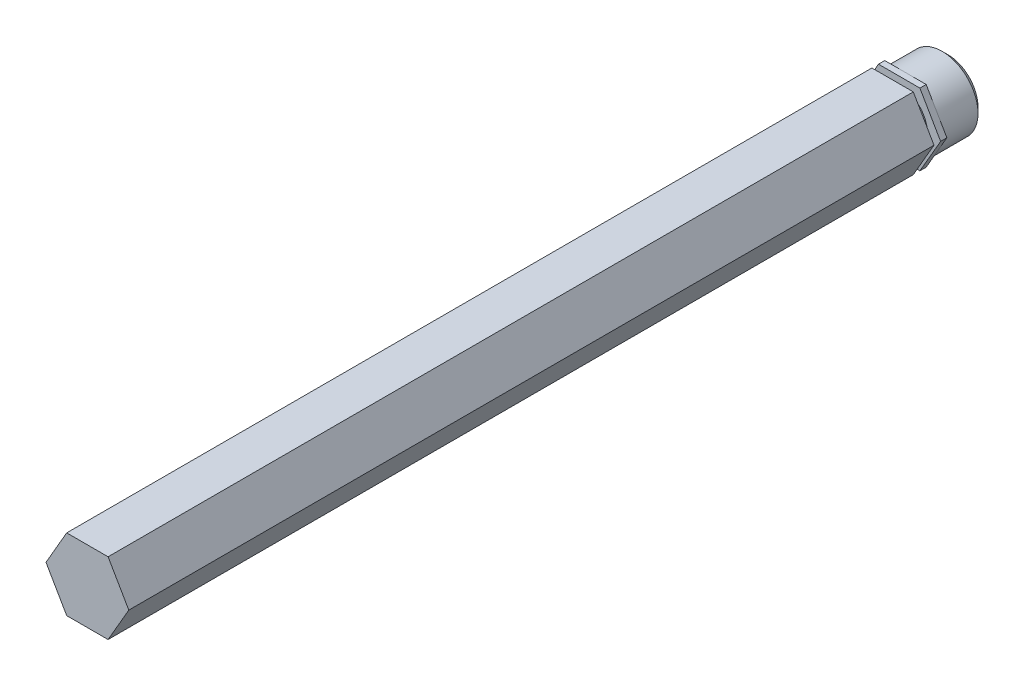
ISO-10303-21;
HEADER;
FILE_DESCRIPTION(('STEP AP214'),'2;1');
FILE_NAME('part.step','',(''),(''),'','','');
FILE_SCHEMA(('AUTOMOTIVE_DESIGN { 1 0 10303 214 1 1 1 1 }'));
ENDSEC;
DATA;
#1=APPLICATION_CONTEXT('core data for automotive mechanical design processes');
#2=APPLICATION_PROTOCOL_DEFINITION('international standard','automotive_design',2000,#1);
#3=PRODUCT_CONTEXT('',#1,'mechanical');
#4=PRODUCT('Part','Part','',(#3));
#5=PRODUCT_RELATED_PRODUCT_CATEGORY('part','',(#4));
#6=PRODUCT_DEFINITION_FORMATION('','',#4);
#7=PRODUCT_DEFINITION_CONTEXT('part definition',#1,'design');
#8=PRODUCT_DEFINITION('design','',#6,#7);
#9=PRODUCT_DEFINITION_SHAPE('','',#8);
#10=(LENGTH_UNIT() NAMED_UNIT(*) SI_UNIT(.MILLI.,.METRE.));
#11=(NAMED_UNIT(*) PLANE_ANGLE_UNIT() SI_UNIT($,.RADIAN.));
#12=(NAMED_UNIT(*) SI_UNIT($,.STERADIAN.) SOLID_ANGLE_UNIT());
#13=UNCERTAINTY_MEASURE_WITH_UNIT(LENGTH_MEASURE(1.E-05),#10,'distance_accuracy_value','');
#14=(GEOMETRIC_REPRESENTATION_CONTEXT(3) GLOBAL_UNCERTAINTY_ASSIGNED_CONTEXT((#13)) GLOBAL_UNIT_ASSIGNED_CONTEXT((#10,
#11,#12)) REPRESENTATION_CONTEXT('',''));
#15=CARTESIAN_POINT('',(0.,0.,0.));
#16=DIRECTION('',(0.,0.,1.));
#17=DIRECTION('',(1.,0.,0.));
#18=AXIS2_PLACEMENT_3D('',#15,#16,#17);
#19=CARTESIAN_POINT('',(7.33234841870824,0.,-76.2));
#20=DIRECTION('',(0.,0.,1.));
#21=DIRECTION('',(1.,0.,0.));
#22=AXIS2_PLACEMENT_3D('',#19,#20,#21);
#23=PLANE('',#22);
#24=CARTESIAN_POINT('',(0.,0.,-76.1999999999716));
#25=DIRECTION('',(0.,0.,1.));
#26=DIRECTION('',(1.,0.,0.));
#27=AXIS2_PLACEMENT_3D('',#24,#25,#26);
#28=CIRCLE('',#27,5.35000000002128);
#29=CARTESIAN_POINT('',(5.35000000002128,0.,-76.1999999999716));
#30=VERTEX_POINT('',#29);
#31=EDGE_CURVE('E19',#30,#30,#28,.T.);
#32=ORIENTED_EDGE('',*,*,#31,.F.);
#33=EDGE_LOOP('',(#32));
#34=FACE_BOUND('',#33,.T.);
#35=ADVANCED_FACE('F16',(#34),#23,.F.);
#36=CARTESIAN_POINT('',(0.,0.,-75.1999999999953));
#37=DIRECTION('',(0.,0.,1.));
#38=DIRECTION('',(1.,0.,0.));
#39=AXIS2_PLACEMENT_3D('',#36,#37,#38);
#40=CONICAL_SURFACE('',#39,6.34999999999764,0.785398163397448);
#41=ORIENTED_EDGE('',*,*,#31,.T.);
#42=EDGE_LOOP('',(#41));
#43=FACE_BOUND('',#42,.T.);
#44=CARTESIAN_POINT('',(0.,0.,-75.2));
#45=DIRECTION('',(0.,0.,-1.));
#46=DIRECTION('',(-1.,0.,0.));
#47=AXIS2_PLACEMENT_3D('',#44,#45,#46);
#48=CIRCLE('',#47,6.35);
#49=CARTESIAN_POINT('',(-6.35,0.,-75.2));
#50=VERTEX_POINT('',#49);
#51=EDGE_CURVE('E133',#50,#50,#48,.F.);
#52=ORIENTED_EDGE('',*,*,#51,.F.);
#53=EDGE_LOOP('',(#52));
#54=FACE_BOUND('',#53,.T.);
#55=ADVANCED_FACE('F503',(#43,#54),#40,.T.);
#56=CARTESIAN_POINT('',(0.,0.,-68.704));
#57=DIRECTION('',(0.,0.,-1.));
#58=DIRECTION('',(-1.,0.,0.));
#59=AXIS2_PLACEMENT_3D('',#56,#57,#58);
#60=CYLINDRICAL_SURFACE('',#59,6.35);
#61=CARTESIAN_POINT('',(0.,0.,-68.704));
#62=DIRECTION('',(0.,0.,-1.));
#63=DIRECTION('',(-1.,0.,0.));
#64=AXIS2_PLACEMENT_3D('',#61,#62,#63);
#65=CIRCLE('',#64,6.35);
#66=CARTESIAN_POINT('',(5.49926131403119,-3.17499999999999,-68.704));
#67=VERTEX_POINT('',#66);
#68=CARTESIAN_POINT('',(5.49926131403118,3.17499999999999,-68.704));
#69=VERTEX_POINT('',#68);
#70=EDGE_CURVE('E120',#67,#69,#65,.F.);
#71=ORIENTED_EDGE('',*,*,#70,.F.);
#72=CARTESIAN_POINT('',(0.,0.,-68.704));
#73=DIRECTION('',(0.,0.,-1.));
#74=DIRECTION('',(-1.,0.,0.));
#75=AXIS2_PLACEMENT_3D('',#72,#73,#74);
#76=CIRCLE('',#75,6.35);
#77=CARTESIAN_POINT('',(0.,-6.35000000000002,-68.704));
#78=VERTEX_POINT('',#77);
#79=EDGE_CURVE('E128',#78,#67,#76,.F.);
#80=ORIENTED_EDGE('',*,*,#79,.F.);
#81=CARTESIAN_POINT('',(0.,0.,-68.704));
#82=DIRECTION('',(0.,0.,-1.));
#83=DIRECTION('',(-1.,0.,0.));
#84=AXIS2_PLACEMENT_3D('',#81,#82,#83);
#85=CIRCLE('',#84,6.35);
#86=CARTESIAN_POINT('',(-5.49926131403119,-3.17500000000001,-68.704));
#87=VERTEX_POINT('',#86);
#88=EDGE_CURVE('E141',#87,#78,#85,.F.);
#89=ORIENTED_EDGE('',*,*,#88,.F.);
#90=CARTESIAN_POINT('',(0.,0.,-68.704));
#91=DIRECTION('',(0.,0.,-1.));
#92=DIRECTION('',(-1.,0.,0.));
#93=AXIS2_PLACEMENT_3D('',#90,#91,#92);
#94=CIRCLE('',#93,6.35);
#95=CARTESIAN_POINT('',(-5.49926131403119,3.175,-68.704));
#96=VERTEX_POINT('',#95);
#97=EDGE_CURVE('E142',#96,#87,#94,.F.);
#98=ORIENTED_EDGE('',*,*,#97,.F.);
#99=CARTESIAN_POINT('',(0.,0.,-68.704));
#100=DIRECTION('',(0.,0.,-1.));
#101=DIRECTION('',(-1.,0.,0.));
#102=AXIS2_PLACEMENT_3D('',#99,#100,#101);
#103=CIRCLE('',#102,6.35);
#104=CARTESIAN_POINT('',(0.,6.35000000000001,-68.704));
#105=VERTEX_POINT('',#104);
#106=EDGE_CURVE('E177',#105,#96,#103,.F.);
#107=ORIENTED_EDGE('',*,*,#106,.F.);
#108=CARTESIAN_POINT('',(0.,0.,-68.704));
#109=DIRECTION('',(0.,0.,-1.));
#110=DIRECTION('',(-1.,0.,0.));
#111=AXIS2_PLACEMENT_3D('',#108,#109,#110);
#112=CIRCLE('',#111,6.35);
#113=EDGE_CURVE('E131',#69,#105,#112,.F.);
#114=ORIENTED_EDGE('',*,*,#113,.F.);
#115=EDGE_LOOP('',(#71,#80,#89,#98,#107,#114));
#116=FACE_BOUND('',#115,.T.);
#117=ORIENTED_EDGE('',*,*,#51,.T.);
#118=EDGE_LOOP('',(#117));
#119=FACE_BOUND('',#118,.T.);
#120=ADVANCED_FACE('F125',(#116,#119),#60,.T.);
#121=CARTESIAN_POINT('',(0.,0.,-68.704));
#122=DIRECTION('',(0.,0.,-1.));
#123=DIRECTION('',(-1.,0.,0.));
#124=AXIS2_PLACEMENT_3D('',#121,#122,#123);
#125=PLANE('',#124);
#126=DIRECTION('',(-0.499999999999999,-0.866025403784439,0.));
#127=VECTOR('',#126,1.);
#128=CARTESIAN_POINT('',(3.6661742093541,-6.35000000000004,-68.704));
#129=LINE('',#128,#127);
#130=CARTESIAN_POINT('',(7.33234841870824,0.,-68.704));
#131=VERTEX_POINT('',#130);
#132=EDGE_CURVE('E148',#131,#67,#129,.T.);
#133=ORIENTED_EDGE('',*,*,#132,.T.);
#134=ORIENTED_EDGE('',*,*,#70,.T.);
#135=DIRECTION('',(0.5,-0.866025403784439,0.));
#136=VECTOR('',#135,1.);
#137=CARTESIAN_POINT('',(7.33234841870824,0.,-68.704));
#138=LINE('',#137,#136);
#139=EDGE_CURVE('E155',#69,#131,#138,.T.);
#140=ORIENTED_EDGE('',*,*,#139,.T.);
#141=EDGE_LOOP('',(#133,#134,#140));
#142=FACE_BOUND('',#141,.T.);
#143=ADVANCED_FACE('F154',(#142),#125,.T.);
#144=CARTESIAN_POINT('',(0.,0.,-68.704));
#145=DIRECTION('',(0.,0.,-1.));
#146=DIRECTION('',(-1.,0.,0.));
#147=AXIS2_PLACEMENT_3D('',#144,#145,#146);
#148=PLANE('',#147);
#149=DIRECTION('',(0.5,-0.866025403784439,0.));
#150=VECTOR('',#149,1.);
#151=CARTESIAN_POINT('',(7.33234841870824,0.,-68.704));
#152=LINE('',#151,#150);
#153=CARTESIAN_POINT('',(3.66617420935411,6.35000000000001,-68.704));
#154=VERTEX_POINT('',#153);
#155=EDGE_CURVE('E152',#154,#69,#152,.T.);
#156=ORIENTED_EDGE('',*,*,#155,.T.);
#157=ORIENTED_EDGE('',*,*,#113,.T.);
#158=DIRECTION('',(1.,0.,0.));
#159=VECTOR('',#158,1.);
#160=CARTESIAN_POINT('',(3.6661742093541,6.35000000000002,-68.704));
#161=LINE('',#160,#159);
#162=EDGE_CURVE('E185',#105,#154,#161,.T.);
#163=ORIENTED_EDGE('',*,*,#162,.T.);
#164=EDGE_LOOP('',(#156,#157,#163));
#165=FACE_BOUND('',#164,.T.);
#166=ADVANCED_FACE('F183',(#165),#148,.T.);
#167=CARTESIAN_POINT('',(0.,0.,-68.704));
#168=DIRECTION('',(0.,0.,-1.));
#169=DIRECTION('',(-1.,0.,0.));
#170=AXIS2_PLACEMENT_3D('',#167,#168,#169);
#171=PLANE('',#170);
#172=ORIENTED_EDGE('',*,*,#106,.T.);
#173=DIRECTION('',(0.5,0.866025403784439,0.));
#174=VECTOR('',#173,1.);
#175=CARTESIAN_POINT('',(-3.66617420935412,6.35000000000002,-68.704));
#176=LINE('',#175,#174);
#177=CARTESIAN_POINT('',(-3.66617420935412,6.35000000000002,-68.704));
#178=VERTEX_POINT('',#177);
#179=EDGE_CURVE('E201',#96,#178,#176,.T.);
#180=ORIENTED_EDGE('',*,*,#179,.T.);
#181=DIRECTION('',(1.,0.,0.));
#182=VECTOR('',#181,1.);
#183=CARTESIAN_POINT('',(3.6661742093541,6.35000000000002,-68.704));
#184=LINE('',#183,#182);
#185=EDGE_CURVE('E194',#178,#105,#184,.T.);
#186=ORIENTED_EDGE('',*,*,#185,.T.);
#187=EDGE_LOOP('',(#172,#180,#186));
#188=FACE_BOUND('',#187,.T.);
#189=ADVANCED_FACE('F200',(#188),#171,.T.);
#190=CARTESIAN_POINT('',(0.,0.,-68.704));
#191=DIRECTION('',(0.,0.,-1.));
#192=DIRECTION('',(-1.,0.,0.));
#193=AXIS2_PLACEMENT_3D('',#190,#191,#192);
#194=PLANE('',#193);
#195=ORIENTED_EDGE('',*,*,#97,.T.);
#196=DIRECTION('',(-0.500000000000001,0.866025403784438,0.));
#197=VECTOR('',#196,1.);
#198=CARTESIAN_POINT('',(-7.33234841870827,0.,-68.704));
#199=LINE('',#198,#197);
#200=CARTESIAN_POINT('',(-7.33234841870827,0.,-68.704));
#201=VERTEX_POINT('',#200);
#202=EDGE_CURVE('E239',#87,#201,#199,.T.);
#203=ORIENTED_EDGE('',*,*,#202,.T.);
#204=DIRECTION('',(0.5,0.866025403784439,0.));
#205=VECTOR('',#204,1.);
#206=CARTESIAN_POINT('',(-3.66617420935412,6.35000000000002,-68.704));
#207=LINE('',#206,#205);
#208=EDGE_CURVE('E213',#201,#96,#207,.T.);
#209=ORIENTED_EDGE('',*,*,#208,.T.);
#210=EDGE_LOOP('',(#195,#203,#209));
#211=FACE_BOUND('',#210,.T.);
#212=ADVANCED_FACE('F467',(#211),#194,.T.);
#213=CARTESIAN_POINT('',(0.,0.,-68.704));
#214=DIRECTION('',(0.,0.,-1.));
#215=DIRECTION('',(-1.,0.,0.));
#216=AXIS2_PLACEMENT_3D('',#213,#214,#215);
#217=PLANE('',#216);
#218=DIRECTION('',(1.,0.,0.));
#219=VECTOR('',#218,1.);
#220=CARTESIAN_POINT('',(-3.66617420935413,-6.35000000000004,-68.704));
#221=LINE('',#220,#219);
#222=CARTESIAN_POINT('',(3.6661742093541,-6.35000000000004,-68.704));
#223=VERTEX_POINT('',#222);
#224=EDGE_CURVE('E140',#223,#78,#221,.F.);
#225=ORIENTED_EDGE('',*,*,#224,.T.);
#226=ORIENTED_EDGE('',*,*,#79,.T.);
#227=DIRECTION('',(-0.499999999999999,-0.866025403784439,0.));
#228=VECTOR('',#227,1.);
#229=CARTESIAN_POINT('',(3.6661742093541,-6.35000000000004,-68.704));
#230=LINE('',#229,#228);
#231=EDGE_CURVE('E138',#67,#223,#230,.T.);
#232=ORIENTED_EDGE('',*,*,#231,.T.);
#233=EDGE_LOOP('',(#225,#226,#232));
#234=FACE_BOUND('',#233,.T.);
#235=ADVANCED_FACE('F137',(#234),#217,.T.);
#236=CARTESIAN_POINT('',(0.,0.,-68.704));
#237=DIRECTION('',(0.,0.,-1.));
#238=DIRECTION('',(-1.,0.,0.));
#239=AXIS2_PLACEMENT_3D('',#236,#237,#238);
#240=PLANE('',#239);
#241=ORIENTED_EDGE('',*,*,#88,.T.);
#242=DIRECTION('',(1.,0.,0.));
#243=VECTOR('',#242,1.);
#244=CARTESIAN_POINT('',(-3.66617420935413,-6.35000000000004,-68.704));
#245=LINE('',#244,#243);
#246=CARTESIAN_POINT('',(-3.66617420935413,-6.35000000000003,-68.704));
#247=VERTEX_POINT('',#246);
#248=EDGE_CURVE('E290',#78,#247,#245,.F.);
#249=ORIENTED_EDGE('',*,*,#248,.T.);
#250=DIRECTION('',(-0.500000000000001,0.866025403784438,0.));
#251=VECTOR('',#250,1.);
#252=CARTESIAN_POINT('',(-7.33234841870827,0.,-68.704));
#253=LINE('',#252,#251);
#254=EDGE_CURVE('E236',#247,#87,#253,.T.);
#255=ORIENTED_EDGE('',*,*,#254,.T.);
#256=EDGE_LOOP('',(#241,#249,#255));
#257=FACE_BOUND('',#256,.T.);
#258=ADVANCED_FACE('F295',(#257),#240,.T.);
#259=CARTESIAN_POINT('',(3.6661742093541,-6.35000000000004,76.2));
#260=DIRECTION('',(-0.866025403784439,0.499999999999999,0.));
#261=DIRECTION('',(-0.499999999999999,-0.866025403784439,0.));
#262=AXIS2_PLACEMENT_3D('',#259,#260,#261);
#263=PLANE('',#262);
#264=DIRECTION('',(0.,0.,1.));
#265=VECTOR('',#264,1.);
#266=CARTESIAN_POINT('',(3.6661742093541,-6.35000000000004,76.2));
#267=LINE('',#266,#265);
#268=CARTESIAN_POINT('',(3.6661742093541,-6.35000000000004,-67.5924));
#269=VERTEX_POINT('',#268);
#270=EDGE_CURVE('E151',#269,#223,#267,.F.);
#271=ORIENTED_EDGE('',*,*,#270,.T.);
#272=ORIENTED_EDGE('',*,*,#231,.F.);
#273=ORIENTED_EDGE('',*,*,#132,.F.);
#274=DIRECTION('',(0.,0.,1.));
#275=VECTOR('',#274,1.);
#276=CARTESIAN_POINT('',(7.33234841870824,0.,76.2));
#277=LINE('',#276,#275);
#278=CARTESIAN_POINT('',(7.33234841870824,0.,-67.5924));
#279=VERTEX_POINT('',#278);
#280=EDGE_CURVE('E202',#131,#279,#277,.T.);
#281=ORIENTED_EDGE('',*,*,#280,.T.);
#282=DIRECTION('',(0.499999999999999,0.866025403784439,0.));
#283=VECTOR('',#282,1.);
#284=CARTESIAN_POINT('',(3.6661742093541,-6.35000000000004,-67.5924));
#285=LINE('',#284,#283);
#286=EDGE_CURVE('E261',#269,#279,#285,.T.);
#287=ORIENTED_EDGE('',*,*,#286,.F.);
#288=EDGE_LOOP('',(#271,#272,#273,#281,#287));
#289=FACE_BOUND('',#288,.T.);
#290=ADVANCED_FACE('F146',(#289),#263,.F.);
#291=CARTESIAN_POINT('',(7.33234841870824,0.,76.2));
#292=DIRECTION('',(-0.866025403784439,-0.5,0.));
#293=DIRECTION('',(0.5,-0.866025403784439,0.));
#294=AXIS2_PLACEMENT_3D('',#291,#292,#293);
#295=PLANE('',#294);
#296=ORIENTED_EDGE('',*,*,#280,.F.);
#297=ORIENTED_EDGE('',*,*,#139,.F.);
#298=ORIENTED_EDGE('',*,*,#155,.F.);
#299=DIRECTION('',(0.,0.,-1.));
#300=VECTOR('',#299,1.);
#301=CARTESIAN_POINT('',(3.6661742093541,6.35000000000002,76.2));
#302=LINE('',#301,#300);
#303=CARTESIAN_POINT('',(3.6661742093541,6.35000000000001,-67.5924));
#304=VERTEX_POINT('',#303);
#305=EDGE_CURVE('E198',#154,#304,#302,.F.);
#306=ORIENTED_EDGE('',*,*,#305,.T.);
#307=DIRECTION('',(-0.5,0.866025403784439,0.));
#308=VECTOR('',#307,1.);
#309=CARTESIAN_POINT('',(7.33234841870824,0.,-67.5924));
#310=LINE('',#309,#308);
#311=EDGE_CURVE('E263',#279,#304,#310,.T.);
#312=ORIENTED_EDGE('',*,*,#311,.F.);
#313=EDGE_LOOP('',(#296,#297,#298,#306,#312));
#314=FACE_BOUND('',#313,.T.);
#315=ADVANCED_FACE('F300',(#314),#295,.F.);
#316=CARTESIAN_POINT('',(3.6661742093541,6.35000000000002,76.2));
#317=DIRECTION('',(0.,-1.,0.));
#318=DIRECTION('',(0.,0.,-1.));
#319=AXIS2_PLACEMENT_3D('',#316,#317,#318);
#320=PLANE('',#319);
#321=ORIENTED_EDGE('',*,*,#305,.F.);
#322=ORIENTED_EDGE('',*,*,#162,.F.);
#323=ORIENTED_EDGE('',*,*,#185,.F.);
#324=DIRECTION('',(0.,0.,1.));
#325=VECTOR('',#324,1.);
#326=CARTESIAN_POINT('',(-3.66617420935412,6.35000000000002,76.2));
#327=LINE('',#326,#325);
#328=CARTESIAN_POINT('',(-3.66617420935412,6.35000000000002,-67.5924));
#329=VERTEX_POINT('',#328);
#330=EDGE_CURVE('E227',#178,#329,#327,.T.);
#331=ORIENTED_EDGE('',*,*,#330,.T.);
#332=DIRECTION('',(1.,0.,0.));
#333=VECTOR('',#332,1.);
#334=CARTESIAN_POINT('',(0.,6.35000000000002,-67.5924));
#335=LINE('',#334,#333);
#336=EDGE_CURVE('E282',#304,#329,#335,.F.);
#337=ORIENTED_EDGE('',*,*,#336,.F.);
#338=EDGE_LOOP('',(#321,#322,#323,#331,#337));
#339=FACE_BOUND('',#338,.T.);
#340=ADVANCED_FACE('F192',(#339),#320,.F.);
#341=CARTESIAN_POINT('',(-3.66617420935412,6.35000000000002,76.2));
#342=DIRECTION('',(0.866025403784439,-0.5,0.));
#343=DIRECTION('',(0.5,0.866025403784439,0.));
#344=AXIS2_PLACEMENT_3D('',#341,#342,#343);
#345=PLANE('',#344);
#346=ORIENTED_EDGE('',*,*,#330,.F.);
#347=ORIENTED_EDGE('',*,*,#179,.F.);
#348=ORIENTED_EDGE('',*,*,#208,.F.);
#349=DIRECTION('',(0.,0.,1.));
#350=VECTOR('',#349,1.);
#351=CARTESIAN_POINT('',(-7.33234841870827,0.,76.2));
#352=LINE('',#351,#350);
#353=CARTESIAN_POINT('',(-7.33234841870827,0.,-67.5924));
#354=VERTEX_POINT('',#353);
#355=EDGE_CURVE('E243',#201,#354,#352,.T.);
#356=ORIENTED_EDGE('',*,*,#355,.T.);
#357=DIRECTION('',(-0.5,-0.866025403784439,0.));
#358=VECTOR('',#357,1.);
#359=CARTESIAN_POINT('',(-3.66617420935412,6.35000000000002,-67.5924));
#360=LINE('',#359,#358);
#361=EDGE_CURVE('E273',#329,#354,#360,.T.);
#362=ORIENTED_EDGE('',*,*,#361,.F.);
#363=EDGE_LOOP('',(#346,#347,#348,#356,#362));
#364=FACE_BOUND('',#363,.T.);
#365=ADVANCED_FACE('F272',(#364),#345,.F.);
#366=CARTESIAN_POINT('',(-7.33234841870827,0.,76.2));
#367=DIRECTION('',(0.866025403784438,0.500000000000001,0.));
#368=DIRECTION('',(-0.500000000000001,0.866025403784438,0.));
#369=AXIS2_PLACEMENT_3D('',#366,#367,#368);
#370=PLANE('',#369);
#371=ORIENTED_EDGE('',*,*,#355,.F.);
#372=ORIENTED_EDGE('',*,*,#202,.F.);
#373=ORIENTED_EDGE('',*,*,#254,.F.);
#374=DIRECTION('',(0.,0.,1.));
#375=VECTOR('',#374,1.);
#376=CARTESIAN_POINT('',(-3.66617420935413,-6.35000000000004,76.2));
#377=LINE('',#376,#375);
#378=CARTESIAN_POINT('',(-3.66617420935413,-6.35000000000004,-67.5924));
#379=VERTEX_POINT('',#378);
#380=EDGE_CURVE('E264',#247,#379,#377,.T.);
#381=ORIENTED_EDGE('',*,*,#380,.T.);
#382=DIRECTION('',(0.500000000000001,-0.866025403784438,0.));
#383=VECTOR('',#382,1.);
#384=CARTESIAN_POINT('',(-7.33234841870827,0.,-67.5924));
#385=LINE('',#384,#383);
#386=EDGE_CURVE('E258',#354,#379,#385,.T.);
#387=ORIENTED_EDGE('',*,*,#386,.F.);
#388=EDGE_LOOP('',(#371,#372,#373,#381,#387));
#389=FACE_BOUND('',#388,.T.);
#390=ADVANCED_FACE('F277',(#389),#370,.F.);
#391=CARTESIAN_POINT('',(-3.66617420935413,-6.35000000000004,76.2));
#392=DIRECTION('',(0.,1.,0.));
#393=DIRECTION('',(0.,0.,1.));
#394=AXIS2_PLACEMENT_3D('',#391,#392,#393);
#395=PLANE('',#394);
#396=ORIENTED_EDGE('',*,*,#380,.F.);
#397=ORIENTED_EDGE('',*,*,#248,.F.);
#398=ORIENTED_EDGE('',*,*,#224,.F.);
#399=ORIENTED_EDGE('',*,*,#270,.F.);
#400=DIRECTION('',(1.,0.,0.));
#401=VECTOR('',#400,1.);
#402=CARTESIAN_POINT('',(0.,-6.35000000000004,-67.5924));
#403=LINE('',#402,#401);
#404=EDGE_CURVE('E174',#379,#269,#403,.T.);
#405=ORIENTED_EDGE('',*,*,#404,.F.);
#406=EDGE_LOOP('',(#396,#397,#398,#399,#405));
#407=FACE_BOUND('',#406,.T.);
#408=ADVANCED_FACE('F297',(#407),#395,.F.);
#409=CARTESIAN_POINT('',(0.,9.67349289505185,-67.5924));
#410=DIRECTION('',(0.,0.,1.));
#411=DIRECTION('',(1.,0.,0.));
#412=AXIS2_PLACEMENT_3D('',#409,#410,#411);
#413=PLANE('',#412);
#414=ORIENTED_EDGE('',*,*,#386,.T.);
#415=ORIENTED_EDGE('',*,*,#404,.T.);
#416=ORIENTED_EDGE('',*,*,#286,.T.);
#417=ORIENTED_EDGE('',*,*,#311,.T.);
#418=ORIENTED_EDGE('',*,*,#336,.T.);
#419=ORIENTED_EDGE('',*,*,#361,.T.);
#420=EDGE_LOOP('',(#414,#415,#416,#417,#418,#419));
#421=FACE_BOUND('',#420,.T.);
#422=CARTESIAN_POINT('',(0.,0.,-67.5924));
#423=DIRECTION('',(0.,0.,1.));
#424=DIRECTION('',(1.,0.,0.));
#425=AXIS2_PLACEMENT_3D('',#422,#423,#424);
#426=CIRCLE('',#425,5.0292);
#427=CARTESIAN_POINT('',(5.0292,0.,-67.5924));
#428=VERTEX_POINT('',#427);
#429=EDGE_CURVE('E171',#428,#428,#426,.T.);
#430=ORIENTED_EDGE('',*,*,#429,.F.);
#431=EDGE_LOOP('',(#430));
#432=FACE_BOUND('',#431,.T.);
#433=ADVANCED_FACE('F298',(#421,#432),#413,.T.);
#434=CARTESIAN_POINT('',(0.,0.,-56.8163271417919));
#435=DIRECTION('',(0.,0.,1.));
#436=DIRECTION('',(1.,0.,0.));
#437=AXIS2_PLACEMENT_3D('',#434,#435,#436);
#438=CYLINDRICAL_SURFACE('',#437,5.0292);
#439=ORIENTED_EDGE('',*,*,#429,.T.);
#440=EDGE_LOOP('',(#439));
#441=FACE_BOUND('',#440,.T.);
#442=CARTESIAN_POINT('',(0.,0.,-66.424));
#443=DIRECTION('',(0.,0.,1.));
#444=DIRECTION('',(1.,0.,0.));
#445=AXIS2_PLACEMENT_3D('',#442,#443,#444);
#446=CIRCLE('',#445,5.0292);
#447=CARTESIAN_POINT('',(5.0292,0.,-66.424));
#448=VERTEX_POINT('',#447);
#449=EDGE_CURVE('E166',#448,#448,#446,.T.);
#450=ORIENTED_EDGE('',*,*,#449,.F.);
#451=EDGE_LOOP('',(#450));
#452=FACE_BOUND('',#451,.T.);
#453=ADVANCED_FACE('F344',(#441,#452),#438,.T.);
#454=CARTESIAN_POINT('',(3.6661742093541,-6.35000000000004,76.2));
#455=DIRECTION('',(-0.866025403784439,0.499999999999999,0.));
#456=DIRECTION('',(-0.499999999999999,-0.866025403784439,0.));
#457=AXIS2_PLACEMENT_3D('',#454,#455,#456);
#458=PLANE('',#457);
#459=DIRECTION('',(0.,0.,1.));
#460=VECTOR('',#459,1.);
#461=CARTESIAN_POINT('',(7.33234841870824,0.,76.2));
#462=LINE('',#461,#460);
#463=CARTESIAN_POINT('',(7.33234841870824,0.,-66.424));
#464=VERTEX_POINT('',#463);
#465=CARTESIAN_POINT('',(7.33234841870824,0.,76.2));
#466=VERTEX_POINT('',#465);
#467=EDGE_CURVE('E545',#464,#466,#462,.T.);
#468=ORIENTED_EDGE('',*,*,#467,.T.);
#469=DIRECTION('',(0.499999999999999,0.866025403784439,0.));
#470=VECTOR('',#469,1.);
#471=CARTESIAN_POINT('',(3.6661742093541,-6.35000000000004,76.2));
#472=LINE('',#471,#470);
#473=CARTESIAN_POINT('',(3.6661742093541,-6.35000000000004,76.2));
#474=VERTEX_POINT('',#473);
#475=EDGE_CURVE('E548',#474,#466,#472,.T.);
#476=ORIENTED_EDGE('',*,*,#475,.F.);
#477=DIRECTION('',(0.,0.,1.));
#478=VECTOR('',#477,1.);
#479=CARTESIAN_POINT('',(3.6661742093541,-6.35000000000004,76.2));
#480=LINE('',#479,#478);
#481=CARTESIAN_POINT('',(3.6661742093541,-6.35000000000004,-66.424));
#482=VERTEX_POINT('',#481);
#483=EDGE_CURVE('E173',#474,#482,#480,.F.);
#484=ORIENTED_EDGE('',*,*,#483,.T.);
#485=DIRECTION('',(-0.499999999999999,-0.866025403784439,0.));
#486=VECTOR('',#485,1.);
#487=CARTESIAN_POINT('',(7.33234841870824,0.,-66.424));
#488=LINE('',#487,#486);
#489=EDGE_CURVE('E169',#464,#482,#488,.T.);
#490=ORIENTED_EDGE('',*,*,#489,.F.);
#491=EDGE_LOOP('',(#468,#476,#484,#490));
#492=FACE_BOUND('',#491,.T.);
#493=ADVANCED_FACE('F340',(#492),#458,.F.);
#494=CARTESIAN_POINT('',(-3.66617420935413,-6.35000000000004,76.2));
#495=DIRECTION('',(0.,1.,0.));
#496=DIRECTION('',(0.,0.,1.));
#497=AXIS2_PLACEMENT_3D('',#494,#495,#496);
#498=PLANE('',#497);
#499=ORIENTED_EDGE('',*,*,#483,.F.);
#500=DIRECTION('',(1.,0.,0.));
#501=VECTOR('',#500,1.);
#502=CARTESIAN_POINT('',(7.33234841870824,-6.35000000000004,76.2));
#503=LINE('',#502,#501);
#504=CARTESIAN_POINT('',(-3.66617420935413,-6.35000000000004,76.2));
#505=VERTEX_POINT('',#504);
#506=EDGE_CURVE('E557',#505,#474,#503,.T.);
#507=ORIENTED_EDGE('',*,*,#506,.F.);
#508=DIRECTION('',(0.,0.,1.));
#509=VECTOR('',#508,1.);
#510=CARTESIAN_POINT('',(-3.66617420935413,-6.35000000000004,76.2));
#511=LINE('',#510,#509);
#512=CARTESIAN_POINT('',(-3.66617420935413,-6.35000000000004,-66.424));
#513=VERTEX_POINT('',#512);
#514=EDGE_CURVE('E170',#505,#513,#511,.F.);
#515=ORIENTED_EDGE('',*,*,#514,.T.);
#516=DIRECTION('',(-1.,0.,0.));
#517=VECTOR('',#516,1.);
#518=CARTESIAN_POINT('',(0.,-6.35000000000004,-66.424));
#519=LINE('',#518,#517);
#520=EDGE_CURVE('E570',#482,#513,#519,.T.);
#521=ORIENTED_EDGE('',*,*,#520,.F.);
#522=EDGE_LOOP('',(#499,#507,#515,#521));
#523=FACE_BOUND('',#522,.T.);
#524=ADVANCED_FACE('F336',(#523),#498,.F.);
#525=CARTESIAN_POINT('',(7.33234841870824,0.,76.2));
#526=DIRECTION('',(-0.866025403784439,-0.5,0.));
#527=DIRECTION('',(0.5,-0.866025403784439,0.));
#528=AXIS2_PLACEMENT_3D('',#525,#526,#527);
#529=PLANE('',#528);
#530=DIRECTION('',(0.,0.,-1.));
#531=VECTOR('',#530,1.);
#532=CARTESIAN_POINT('',(3.6661742093541,6.35000000000002,76.2));
#533=LINE('',#532,#531);
#534=CARTESIAN_POINT('',(3.6661742093541,6.35000000000002,-66.424));
#535=VERTEX_POINT('',#534);
#536=CARTESIAN_POINT('',(3.6661742093541,6.35000000000001,76.2));
#537=VERTEX_POINT('',#536);
#538=EDGE_CURVE('E551',#535,#537,#533,.F.);
#539=ORIENTED_EDGE('',*,*,#538,.T.);
#540=DIRECTION('',(-0.5,0.866025403784439,0.));
#541=VECTOR('',#540,1.);
#542=CARTESIAN_POINT('',(7.33234841870824,0.,76.2));
#543=LINE('',#542,#541);
#544=EDGE_CURVE('E553',#466,#537,#543,.T.);
#545=ORIENTED_EDGE('',*,*,#544,.F.);
#546=ORIENTED_EDGE('',*,*,#467,.F.);
#547=DIRECTION('',(0.5,-0.866025403784439,0.));
#548=VECTOR('',#547,1.);
#549=CARTESIAN_POINT('',(3.6661742093541,6.35000000000002,-66.424));
#550=LINE('',#549,#548);
#551=EDGE_CURVE('E576',#535,#464,#550,.T.);
#552=ORIENTED_EDGE('',*,*,#551,.F.);
#553=EDGE_LOOP('',(#539,#545,#546,#552));
#554=FACE_BOUND('',#553,.T.);
#555=ADVANCED_FACE('F332',(#554),#529,.F.);
#556=CARTESIAN_POINT('',(3.6661742093541,6.35000000000002,76.2));
#557=DIRECTION('',(0.,-1.,0.));
#558=DIRECTION('',(0.,0.,-1.));
#559=AXIS2_PLACEMENT_3D('',#556,#557,#558);
#560=PLANE('',#559);
#561=DIRECTION('',(0.,0.,1.));
#562=VECTOR('',#561,1.);
#563=CARTESIAN_POINT('',(-3.66617420935412,6.35000000000002,76.2));
#564=LINE('',#563,#562);
#565=CARTESIAN_POINT('',(-3.66617420935412,6.35000000000002,-66.424));
#566=VERTEX_POINT('',#565);
#567=CARTESIAN_POINT('',(-3.66617420935412,6.35000000000002,76.2));
#568=VERTEX_POINT('',#567);
#569=EDGE_CURVE('E578',#566,#568,#564,.T.);
#570=ORIENTED_EDGE('',*,*,#569,.T.);
#571=DIRECTION('',(1.,0.,0.));
#572=VECTOR('',#571,1.);
#573=CARTESIAN_POINT('',(7.33234841870824,6.35000000000002,76.2));
#574=LINE('',#573,#572);
#575=EDGE_CURVE('E555',#537,#568,#574,.F.);
#576=ORIENTED_EDGE('',*,*,#575,.F.);
#577=ORIENTED_EDGE('',*,*,#538,.F.);
#578=DIRECTION('',(-1.,0.,0.));
#579=VECTOR('',#578,1.);
#580=CARTESIAN_POINT('',(0.,6.35000000000002,-66.424));
#581=LINE('',#580,#579);
#582=EDGE_CURVE('E573',#566,#535,#581,.F.);
#583=ORIENTED_EDGE('',*,*,#582,.F.);
#584=EDGE_LOOP('',(#570,#576,#577,#583));
#585=FACE_BOUND('',#584,.T.);
#586=ADVANCED_FACE('F328',(#585),#560,.F.);
#587=CARTESIAN_POINT('',(7.33234841870824,0.,76.2));
#588=DIRECTION('',(0.,0.,1.));
#589=DIRECTION('',(1.,0.,0.));
#590=AXIS2_PLACEMENT_3D('',#587,#588,#589);
#591=PLANE('',#590);
#592=DIRECTION('',(-0.500000000000001,0.866025403784438,0.));
#593=VECTOR('',#592,1.);
#594=CARTESIAN_POINT('',(-7.33234841870827,0.,76.2));
#595=LINE('',#594,#593);
#596=CARTESIAN_POINT('',(-7.33234841870827,0.,76.2));
#597=VERTEX_POINT('',#596);
#598=EDGE_CURVE('E564',#597,#505,#595,.F.);
#599=ORIENTED_EDGE('',*,*,#598,.T.);
#600=ORIENTED_EDGE('',*,*,#506,.T.);
#601=ORIENTED_EDGE('',*,*,#475,.T.);
#602=ORIENTED_EDGE('',*,*,#544,.T.);
#603=ORIENTED_EDGE('',*,*,#575,.T.);
#604=DIRECTION('',(0.5,0.866025403784439,0.));
#605=VECTOR('',#604,1.);
#606=CARTESIAN_POINT('',(-3.66617420935412,6.35000000000002,76.2));
#607=LINE('',#606,#605);
#608=EDGE_CURVE('E581',#568,#597,#607,.F.);
#609=ORIENTED_EDGE('',*,*,#608,.T.);
#610=EDGE_LOOP('',(#599,#600,#601,#602,#603,#609));
#611=FACE_BOUND('',#610,.T.);
#612=ADVANCED_FACE('F324',(#611),#591,.T.);
#613=CARTESIAN_POINT('',(-7.33234841870827,0.,76.2));
#614=DIRECTION('',(0.866025403784438,0.500000000000001,0.));
#615=DIRECTION('',(-0.500000000000001,0.866025403784438,0.));
#616=AXIS2_PLACEMENT_3D('',#613,#614,#615);
#617=PLANE('',#616);
#618=ORIENTED_EDGE('',*,*,#514,.F.);
#619=ORIENTED_EDGE('',*,*,#598,.F.);
#620=DIRECTION('',(0.,0.,1.));
#621=VECTOR('',#620,1.);
#622=CARTESIAN_POINT('',(-7.33234841870827,0.,76.2));
#623=LINE('',#622,#621);
#624=CARTESIAN_POINT('',(-7.33234841870827,0.,-66.424));
#625=VERTEX_POINT('',#624);
#626=EDGE_CURVE('E25',#597,#625,#623,.F.);
#627=ORIENTED_EDGE('',*,*,#626,.T.);
#628=DIRECTION('',(-0.500000000000001,0.866025403784438,0.));
#629=VECTOR('',#628,1.);
#630=CARTESIAN_POINT('',(-3.66617420935413,-6.35000000000004,-66.424));
#631=LINE('',#630,#629);
#632=EDGE_CURVE('E33',#513,#625,#631,.T.);
#633=ORIENTED_EDGE('',*,*,#632,.F.);
#634=EDGE_LOOP('',(#618,#619,#627,#633));
#635=FACE_BOUND('',#634,.T.);
#636=ADVANCED_FACE('F318',(#635),#617,.F.);
#637=CARTESIAN_POINT('',(0.,9.67349289505185,-66.424));
#638=DIRECTION('',(0.,0.,-1.));
#639=DIRECTION('',(-1.,0.,0.));
#640=AXIS2_PLACEMENT_3D('',#637,#638,#639);
#641=PLANE('',#640);
#642=ORIENTED_EDGE('',*,*,#582,.T.);
#643=ORIENTED_EDGE('',*,*,#551,.T.);
#644=ORIENTED_EDGE('',*,*,#489,.T.);
#645=ORIENTED_EDGE('',*,*,#520,.T.);
#646=ORIENTED_EDGE('',*,*,#632,.T.);
#647=DIRECTION('',(0.5,0.866025403784439,0.));
#648=VECTOR('',#647,1.);
#649=CARTESIAN_POINT('',(-3.66617420935412,6.35000000000002,-66.424));
#650=LINE('',#649,#648);
#651=EDGE_CURVE('E11',#625,#566,#650,.T.);
#652=ORIENTED_EDGE('',*,*,#651,.T.);
#653=EDGE_LOOP('',(#642,#643,#644,#645,#646,#652));
#654=FACE_BOUND('',#653,.T.);
#655=ORIENTED_EDGE('',*,*,#449,.T.);
#656=EDGE_LOOP('',(#655));
#657=FACE_BOUND('',#656,.T.);
#658=ADVANCED_FACE('F312',(#654,#657),#641,.T.);
#659=CARTESIAN_POINT('',(-3.66617420935412,6.35000000000002,76.2));
#660=DIRECTION('',(0.866025403784439,-0.5,0.));
#661=DIRECTION('',(0.5,0.866025403784439,0.));
#662=AXIS2_PLACEMENT_3D('',#659,#660,#661);
#663=PLANE('',#662);
#664=ORIENTED_EDGE('',*,*,#626,.F.);
#665=ORIENTED_EDGE('',*,*,#608,.F.);
#666=ORIENTED_EDGE('',*,*,#569,.F.);
#667=ORIENTED_EDGE('',*,*,#651,.F.);
#668=EDGE_LOOP('',(#664,#665,#666,#667));
#669=FACE_BOUND('',#668,.T.);
#670=ADVANCED_FACE('F310',(#669),#663,.F.);
#671=CLOSED_SHELL('',(#35,#55,#120,#143,#166,#189,#212,#235,#258,#290,#315,#340,#365,#390,#408,
#433,#453,#493,#524,#555,#586,#612,#636,#658,#670));
#672=MANIFOLD_SOLID_BREP('B1',#671);
#673=ADVANCED_BREP_SHAPE_REPRESENTATION('',(#18,#672),#14);
#674=SHAPE_DEFINITION_REPRESENTATION(#9,#673);
ENDSEC;
END-ISO-10303-21;
